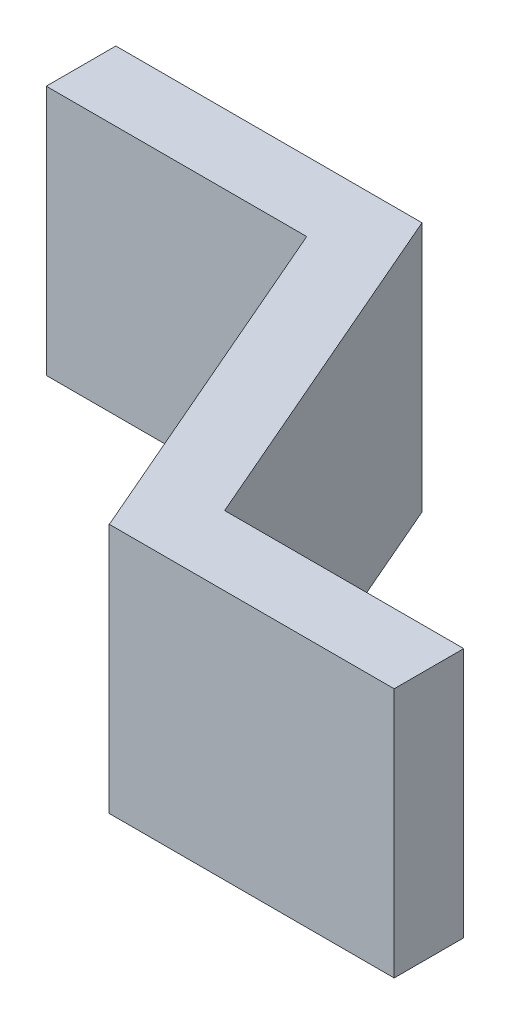
ISO-10303-21;
HEADER;
FILE_DESCRIPTION(('STEP AP214'),'2;1');
FILE_NAME('part.step','',(''),(''),'','','');
FILE_SCHEMA(('AUTOMOTIVE_DESIGN { 1 0 10303 214 1 1 1 1 }'));
ENDSEC;
DATA;
#1=APPLICATION_CONTEXT('core data for automotive mechanical design processes');
#2=APPLICATION_PROTOCOL_DEFINITION('international standard','automotive_design',2000,#1);
#3=PRODUCT_CONTEXT('',#1,'mechanical');
#4=PRODUCT('Part','Part','',(#3));
#5=PRODUCT_RELATED_PRODUCT_CATEGORY('part','',(#4));
#6=PRODUCT_DEFINITION_FORMATION('','',#4);
#7=PRODUCT_DEFINITION_CONTEXT('part definition',#1,'design');
#8=PRODUCT_DEFINITION('design','',#6,#7);
#9=PRODUCT_DEFINITION_SHAPE('','',#8);
#10=(LENGTH_UNIT() NAMED_UNIT(*) SI_UNIT(.MILLI.,.METRE.));
#11=(NAMED_UNIT(*) PLANE_ANGLE_UNIT() SI_UNIT($,.RADIAN.));
#12=(NAMED_UNIT(*) SI_UNIT($,.STERADIAN.) SOLID_ANGLE_UNIT());
#13=UNCERTAINTY_MEASURE_WITH_UNIT(LENGTH_MEASURE(1.E-05),#10,'distance_accuracy_value','');
#14=(GEOMETRIC_REPRESENTATION_CONTEXT(3) GLOBAL_UNCERTAINTY_ASSIGNED_CONTEXT((#13)) GLOBAL_UNIT_ASSIGNED_CONTEXT((#10,
#11,#12)) REPRESENTATION_CONTEXT('',''));
#15=CARTESIAN_POINT('',(0.,0.,0.));
#16=DIRECTION('',(0.,0.,1.));
#17=DIRECTION('',(1.,0.,0.));
#18=AXIS2_PLACEMENT_3D('',#15,#16,#17);
#19=CARTESIAN_POINT('',(0.,5.02,0.));
#20=DIRECTION('',(1.,0.,0.));
#21=DIRECTION('',(0.,0.,-1.));
#22=AXIS2_PLACEMENT_3D('',#19,#20,#21);
#23=PLANE('',#22);
#24=DIRECTION('',(0.,1.,0.));
#25=VECTOR('',#24,1.);
#26=CARTESIAN_POINT('',(0.,5.02,0.));
#27=LINE('',#26,#25);
#28=CARTESIAN_POINT('',(0.,5.380000014305,-1.30339419427667E-10));
#29=VERTEX_POINT('',#28);
#30=CARTESIAN_POINT('',(0.,5.02,-1.556831963824E-10));
#31=VERTEX_POINT('',#30);
#32=EDGE_CURVE('E123',#29,#31,#27,.F.);
#33=ORIENTED_EDGE('',*,*,#32,.T.);
#34=DIRECTION('',(0.,0.,1.));
#35=VECTOR('',#34,1.);
#36=CARTESIAN_POINT('',(0.,5.02,0.));
#37=LINE('',#36,#35);
#38=CARTESIAN_POINT('',(0.,5.02,0.10000000149));
#39=VERTEX_POINT('',#38);
#40=EDGE_CURVE('E115',#31,#39,#37,.T.);
#41=ORIENTED_EDGE('',*,*,#40,.T.);
#42=DIRECTION('',(0.,1.,0.));
#43=VECTOR('',#42,1.);
#44=CARTESIAN_POINT('',(0.,5.02,0.10000000149));
#45=LINE('',#44,#43);
#46=CARTESIAN_POINT('',(0.,5.380000014305,0.10000000149));
#47=VERTEX_POINT('',#46);
#48=EDGE_CURVE('E134',#47,#39,#45,.F.);
#49=ORIENTED_EDGE('',*,*,#48,.F.);
#50=DIRECTION('',(0.,0.,1.));
#51=VECTOR('',#50,1.);
#52=CARTESIAN_POINT('',(0.,5.380000014305,0.));
#53=LINE('',#52,#51);
#54=EDGE_CURVE('E140',#29,#47,#53,.T.);
#55=ORIENTED_EDGE('',*,*,#54,.F.);
#56=EDGE_LOOP('',(#33,#41,#49,#55));
#57=FACE_BOUND('',#56,.T.);
#58=ADVANCED_FACE('F17',(#57),#23,.F.);
#59=CARTESIAN_POINT('',(0.,5.02,0.10000000149));
#60=DIRECTION('',(0.,0.,1.));
#61=DIRECTION('',(1.,0.,0.));
#62=AXIS2_PLACEMENT_3D('',#59,#60,#61);
#63=PLANE('',#62);
#64=DIRECTION('',(0.,1.,0.));
#65=VECTOR('',#64,1.);
#66=CARTESIAN_POINT('',(0.374312226605181,5.02,0.100000001489922));
#67=LINE('',#66,#65);
#68=CARTESIAN_POINT('',(0.37431222660506,5.380000014305,0.100000001489974));
#69=VERTEX_POINT('',#68);
#70=CARTESIAN_POINT('',(0.374312226605091,5.02,0.100000001489974));
#71=VERTEX_POINT('',#70);
#72=EDGE_CURVE('E132',#69,#71,#67,.F.);
#73=ORIENTED_EDGE('',*,*,#72,.F.);
#74=DIRECTION('',(1.,0.,0.));
#75=VECTOR('',#74,1.);
#76=CARTESIAN_POINT('',(0.44,5.380000014305,0.10000000149));
#77=LINE('',#76,#75);
#78=EDGE_CURVE('E137',#47,#69,#77,.T.);
#79=ORIENTED_EDGE('',*,*,#78,.F.);
#80=ORIENTED_EDGE('',*,*,#48,.T.);
#81=DIRECTION('',(1.,0.,0.));
#82=VECTOR('',#81,1.);
#83=CARTESIAN_POINT('',(0.44,5.02,0.10000000149));
#84=LINE('',#83,#82);
#85=EDGE_CURVE('E111',#39,#71,#84,.T.);
#86=ORIENTED_EDGE('',*,*,#85,.T.);
#87=EDGE_LOOP('',(#73,#79,#80,#86));
#88=FACE_BOUND('',#87,.T.);
#89=ADVANCED_FACE('F214',(#88),#63,.T.);
#90=CARTESIAN_POINT('',(0.348224508223,5.02,0.03971472531736));
#91=DIRECTION('',(-0.917754904098641,0.,0.397147247255844));
#92=DIRECTION('',(0.397147247255844,0.,0.917754904098641));
#93=AXIS2_PLACEMENT_3D('',#90,#91,#92);
#94=PLANE('',#93);
#95=DIRECTION('',(0.397147247255413,0.,0.917754904098827));
#96=VECTOR('',#95,1.);
#97=CARTESIAN_POINT('',(0.374312226605,5.02,0.10000000149));
#98=LINE('',#97,#96);
#99=CARTESIAN_POINT('',(0.59,5.02,0.59842599627));
#100=VERTEX_POINT('',#99);
#101=EDGE_CURVE('E110',#71,#100,#98,.T.);
#102=ORIENTED_EDGE('',*,*,#101,.T.);
#103=DIRECTION('',(0.,1.,0.));
#104=VECTOR('',#103,1.);
#105=CARTESIAN_POINT('',(0.59,5.02,0.59842599627));
#106=LINE('',#105,#104);
#107=CARTESIAN_POINT('',(0.59,5.380000014305,0.59842599627));
#108=VERTEX_POINT('',#107);
#109=EDGE_CURVE('E86',#100,#108,#106,.T.);
#110=ORIENTED_EDGE('',*,*,#109,.T.);
#111=DIRECTION('',(0.397147247255413,0.,0.917754904098827));
#112=VECTOR('',#111,1.);
#113=CARTESIAN_POINT('',(0.374312226605,5.380000014305,0.10000000149));
#114=LINE('',#113,#112);
#115=EDGE_CURVE('E139',#69,#108,#114,.T.);
#116=ORIENTED_EDGE('',*,*,#115,.F.);
#117=ORIENTED_EDGE('',*,*,#72,.T.);
#118=EDGE_LOOP('',(#102,#110,#116,#117));
#119=FACE_BOUND('',#118,.T.);
#120=ADVANCED_FACE('F215',(#119),#94,.T.);
#121=CARTESIAN_POINT('',(0.59,5.02,0.5));
#122=DIRECTION('',(1.,0.,0.));
#123=DIRECTION('',(0.,0.,-1.));
#124=AXIS2_PLACEMENT_3D('',#121,#122,#123);
#125=PLANE('',#124);
#126=ORIENTED_EDGE('',*,*,#109,.F.);
#127=DIRECTION('',(0.,0.,-1.));
#128=VECTOR('',#127,1.);
#129=CARTESIAN_POINT('',(0.59,5.02,0.5));
#130=LINE('',#129,#128);
#131=CARTESIAN_POINT('',(0.59,5.02,0.60000000149));
#132=VERTEX_POINT('',#131);
#133=EDGE_CURVE('E20',#100,#132,#130,.F.);
#134=ORIENTED_EDGE('',*,*,#133,.T.);
#135=DIRECTION('',(0.,1.,0.));
#136=VECTOR('',#135,1.);
#137=CARTESIAN_POINT('',(0.59,5.02,0.60000000149));
#138=LINE('',#137,#136);
#139=CARTESIAN_POINT('',(0.59,5.380000014305,0.60000000149));
#140=VERTEX_POINT('',#139);
#141=EDGE_CURVE('E93',#140,#132,#138,.F.);
#142=ORIENTED_EDGE('',*,*,#141,.F.);
#143=DIRECTION('',(0.,0.,1.));
#144=VECTOR('',#143,1.);
#145=CARTESIAN_POINT('',(0.59,5.380000014305,0.));
#146=LINE('',#145,#144);
#147=EDGE_CURVE('E182',#108,#140,#146,.T.);
#148=ORIENTED_EDGE('',*,*,#147,.F.);
#149=EDGE_LOOP('',(#126,#134,#142,#148));
#150=FACE_BOUND('',#149,.T.);
#151=ADVANCED_FACE('F109',(#150),#125,.F.);
#152=CARTESIAN_POINT('',(0.59,5.02,0.60000000149));
#153=DIRECTION('',(0.,0.,1.));
#154=DIRECTION('',(1.,0.,0.));
#155=AXIS2_PLACEMENT_3D('',#152,#153,#154);
#156=PLANE('',#155);
#157=ORIENTED_EDGE('',*,*,#141,.T.);
#158=DIRECTION('',(1.,0.,0.));
#159=VECTOR('',#158,1.);
#160=CARTESIAN_POINT('',(0.44,5.02,0.60000000149));
#161=LINE('',#160,#159);
#162=CARTESIAN_POINT('',(0.999999996424,5.02,0.60000000149));
#163=VERTEX_POINT('',#162);
#164=EDGE_CURVE('E97',#132,#163,#161,.T.);
#165=ORIENTED_EDGE('',*,*,#164,.T.);
#166=DIRECTION('',(0.,1.,0.));
#167=VECTOR('',#166,1.);
#168=CARTESIAN_POINT('',(0.999999996424,5.02,0.60000000149));
#169=LINE('',#168,#167);
#170=CARTESIAN_POINT('',(0.999999996424,5.380000014305,0.60000000149));
#171=VERTEX_POINT('',#170);
#172=EDGE_CURVE('E99',#171,#163,#169,.F.);
#173=ORIENTED_EDGE('',*,*,#172,.F.);
#174=DIRECTION('',(1.,0.,0.));
#175=VECTOR('',#174,1.);
#176=CARTESIAN_POINT('',(0.44,5.380000014305,0.60000000149));
#177=LINE('',#176,#175);
#178=EDGE_CURVE('E98',#140,#171,#177,.T.);
#179=ORIENTED_EDGE('',*,*,#178,.F.);
#180=EDGE_LOOP('',(#157,#165,#173,#179));
#181=FACE_BOUND('',#180,.T.);
#182=ADVANCED_FACE('F95',(#181),#156,.T.);
#183=CARTESIAN_POINT('',(0.999999996424,5.02,0.5));
#184=DIRECTION('',(1.,0.,0.));
#185=DIRECTION('',(0.,0.,-1.));
#186=AXIS2_PLACEMENT_3D('',#183,#184,#185);
#187=PLANE('',#186);
#188=DIRECTION('',(0.,0.,1.));
#189=VECTOR('',#188,1.);
#190=CARTESIAN_POINT('',(0.999999996424,5.02,0.));
#191=LINE('',#190,#189);
#192=CARTESIAN_POINT('',(0.999999996424,5.02,0.5));
#193=VERTEX_POINT('',#192);
#194=EDGE_CURVE('E107',#163,#193,#191,.F.);
#195=ORIENTED_EDGE('',*,*,#194,.T.);
#196=DIRECTION('',(0.,1.,0.));
#197=VECTOR('',#196,1.);
#198=CARTESIAN_POINT('',(0.999999996424,5.02,0.5));
#199=LINE('',#198,#197);
#200=CARTESIAN_POINT('',(0.999999996424,5.380000014305,0.5));
#201=VERTEX_POINT('',#200);
#202=EDGE_CURVE('E192',#193,#201,#199,.T.);
#203=ORIENTED_EDGE('',*,*,#202,.T.);
#204=DIRECTION('',(0.,0.,1.));
#205=VECTOR('',#204,1.);
#206=CARTESIAN_POINT('',(0.999999996424,5.380000014305,0.));
#207=LINE('',#206,#205);
#208=EDGE_CURVE('E126',#171,#201,#207,.F.);
#209=ORIENTED_EDGE('',*,*,#208,.F.);
#210=ORIENTED_EDGE('',*,*,#172,.T.);
#211=EDGE_LOOP('',(#195,#203,#209,#210));
#212=FACE_BOUND('',#211,.T.);
#213=ADVANCED_FACE('F238',(#212),#187,.T.);
#214=CARTESIAN_POINT('',(0.,5.02,0.));
#215=DIRECTION('',(0.,0.,1.));
#216=DIRECTION('',(1.,0.,0.));
#217=AXIS2_PLACEMENT_3D('',#214,#215,#216);
#218=PLANE('',#217);
#219=DIRECTION('',(1.,0.,0.));
#220=VECTOR('',#219,1.);
#221=CARTESIAN_POINT('',(0.44,5.02,-2.335247945736E-10));
#222=LINE('',#221,#220);
#223=CARTESIAN_POINT('',(0.439999999656335,5.02,-3.43069646239979E-10));
#224=VERTEX_POINT('',#223);
#225=EDGE_CURVE('E155',#224,#31,#222,.F.);
#226=ORIENTED_EDGE('',*,*,#225,.T.);
#227=ORIENTED_EDGE('',*,*,#32,.F.);
#228=DIRECTION('',(1.,0.,0.));
#229=VECTOR('',#228,1.);
#230=CARTESIAN_POINT('',(0.44,5.380000014305,-1.955091291415E-10));
#231=LINE('',#230,#229);
#232=CARTESIAN_POINT('',(0.439999999458534,5.380000014305,-1.955091291415E-10));
#233=VERTEX_POINT('',#232);
#234=EDGE_CURVE('E147',#233,#29,#231,.F.);
#235=ORIENTED_EDGE('',*,*,#234,.F.);
#236=DIRECTION('',(0.,1.,0.));
#237=VECTOR('',#236,1.);
#238=CARTESIAN_POINT('',(0.439999999804137,5.02,-4.52614497906357E-10));
#239=LINE('',#238,#237);
#240=EDGE_CURVE('E128',#233,#224,#239,.F.);
#241=ORIENTED_EDGE('',*,*,#240,.T.);
#242=EDGE_LOOP('',(#226,#227,#235,#241));
#243=FACE_BOUND('',#242,.T.);
#244=ADVANCED_FACE('F235',(#243),#218,.F.);
#245=CARTESIAN_POINT('',(0.44,5.02,0.));
#246=DIRECTION('',(0.,1.,0.));
#247=DIRECTION('',(0.,0.,1.));
#248=AXIS2_PLACEMENT_3D('',#245,#246,#247);
#249=PLANE('',#248);
#250=DIRECTION('',(1.,0.,0.));
#251=VECTOR('',#250,1.);
#252=CARTESIAN_POINT('',(0.59,5.02,0.5));
#253=LINE('',#252,#251);
#254=CARTESIAN_POINT('',(0.656368904967001,5.02,0.499999999999999));
#255=VERTEX_POINT('',#254);
#256=EDGE_CURVE('E166',#255,#193,#253,.T.);
#257=ORIENTED_EDGE('',*,*,#256,.T.);
#258=ORIENTED_EDGE('',*,*,#194,.F.);
#259=ORIENTED_EDGE('',*,*,#164,.F.);
#260=ORIENTED_EDGE('',*,*,#133,.F.);
#261=ORIENTED_EDGE('',*,*,#101,.F.);
#262=ORIENTED_EDGE('',*,*,#85,.F.);
#263=ORIENTED_EDGE('',*,*,#40,.F.);
#264=ORIENTED_EDGE('',*,*,#225,.F.);
#265=DIRECTION('',(0.397147247255844,0.,0.917754904098641));
#266=VECTOR('',#265,1.);
#267=CARTESIAN_POINT('',(0.44,5.02,0.));
#268=LINE('',#267,#266);
#269=EDGE_CURVE('E160',#224,#255,#268,.T.);
#270=ORIENTED_EDGE('',*,*,#269,.T.);
#271=EDGE_LOOP('',(#257,#258,#259,#260,#261,#262,#263,#264,#270));
#272=FACE_BOUND('',#271,.T.);
#273=ADVANCED_FACE('F104',(#272),#249,.F.);
#274=CARTESIAN_POINT('',(0.59,5.02,0.5));
#275=DIRECTION('',(0.,0.,1.));
#276=DIRECTION('',(1.,0.,0.));
#277=AXIS2_PLACEMENT_3D('',#274,#275,#276);
#278=PLANE('',#277);
#279=ORIENTED_EDGE('',*,*,#256,.F.);
#280=DIRECTION('',(0.,1.,0.));
#281=VECTOR('',#280,1.);
#282=CARTESIAN_POINT('',(0.656368904967005,5.02,0.499999999999998));
#283=LINE('',#282,#281);
#284=CARTESIAN_POINT('',(0.656368904967001,5.380000014305,0.499999999999999));
#285=VERTEX_POINT('',#284);
#286=EDGE_CURVE('E26',#255,#285,#283,.T.);
#287=ORIENTED_EDGE('',*,*,#286,.T.);
#288=DIRECTION('',(1.,0.,0.));
#289=VECTOR('',#288,1.);
#290=CARTESIAN_POINT('',(0.44,5.380000014305,0.5));
#291=LINE('',#290,#289);
#292=EDGE_CURVE('E34',#201,#285,#291,.F.);
#293=ORIENTED_EDGE('',*,*,#292,.F.);
#294=ORIENTED_EDGE('',*,*,#202,.F.);
#295=EDGE_LOOP('',(#279,#287,#293,#294));
#296=FACE_BOUND('',#295,.T.);
#297=ADVANCED_FACE('F199',(#296),#278,.F.);
#298=CARTESIAN_POINT('',(0.44,5.380000014305,0.));
#299=DIRECTION('',(0.,1.,0.));
#300=DIRECTION('',(0.,0.,1.));
#301=AXIS2_PLACEMENT_3D('',#298,#299,#300);
#302=PLANE('',#301);
#303=ORIENTED_EDGE('',*,*,#178,.T.);
#304=ORIENTED_EDGE('',*,*,#208,.T.);
#305=ORIENTED_EDGE('',*,*,#292,.T.);
#306=DIRECTION('',(0.397147247255844,0.,0.917754904098641));
#307=VECTOR('',#306,1.);
#308=CARTESIAN_POINT('',(0.44,5.380000014305,0.));
#309=LINE('',#308,#307);
#310=EDGE_CURVE('E11',#285,#233,#309,.F.);
#311=ORIENTED_EDGE('',*,*,#310,.T.);
#312=ORIENTED_EDGE('',*,*,#234,.T.);
#313=ORIENTED_EDGE('',*,*,#54,.T.);
#314=ORIENTED_EDGE('',*,*,#78,.T.);
#315=ORIENTED_EDGE('',*,*,#115,.T.);
#316=ORIENTED_EDGE('',*,*,#147,.T.);
#317=EDGE_LOOP('',(#303,#304,#305,#311,#312,#313,#314,#315,#316));
#318=FACE_BOUND('',#317,.T.);
#319=ADVANCED_FACE('F204',(#318),#302,.T.);
#320=CARTESIAN_POINT('',(0.44,5.02,0.));
#321=DIRECTION('',(-0.917754904098641,0.,0.397147247255844));
#322=DIRECTION('',(0.397147247255844,0.,0.917754904098641));
#323=AXIS2_PLACEMENT_3D('',#320,#321,#322);
#324=PLANE('',#323);
#325=ORIENTED_EDGE('',*,*,#286,.F.);
#326=ORIENTED_EDGE('',*,*,#269,.F.);
#327=ORIENTED_EDGE('',*,*,#240,.F.);
#328=ORIENTED_EDGE('',*,*,#310,.F.);
#329=EDGE_LOOP('',(#325,#326,#327,#328));
#330=FACE_BOUND('',#329,.T.);
#331=ADVANCED_FACE('F201',(#330),#324,.F.);
#332=CLOSED_SHELL('',(#58,#89,#120,#151,#182,#213,#244,#273,#297,#319,#331));
#333=MANIFOLD_SOLID_BREP('B1',#332);
#334=ADVANCED_BREP_SHAPE_REPRESENTATION('',(#18,#333),#14);
#335=SHAPE_DEFINITION_REPRESENTATION(#9,#334);
ENDSEC;
END-ISO-10303-21;
